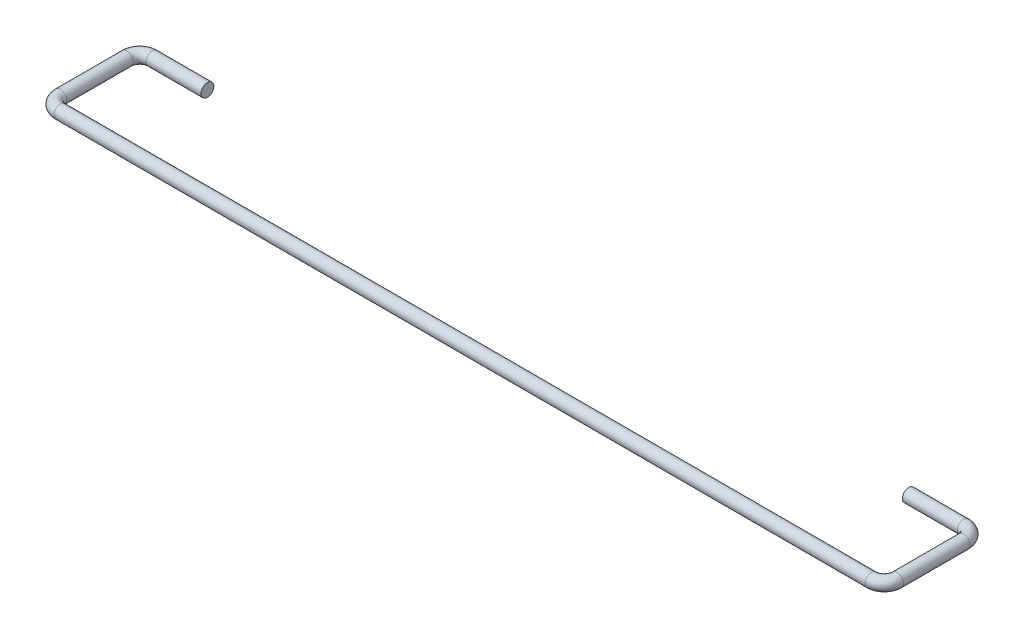
ISO-10303-21;
HEADER;
FILE_DESCRIPTION(('STEP AP214'),'2;1');
FILE_NAME('part.step','',(''),(''),'','','');
FILE_SCHEMA(('AUTOMOTIVE_DESIGN { 1 0 10303 214 1 1 1 1 }'));
ENDSEC;
DATA;
#1=APPLICATION_CONTEXT('core data for automotive mechanical design processes');
#2=APPLICATION_PROTOCOL_DEFINITION('international standard','automotive_design',2000,#1);
#3=PRODUCT_CONTEXT('',#1,'mechanical');
#4=PRODUCT('Part','Part','',(#3));
#5=PRODUCT_RELATED_PRODUCT_CATEGORY('part','',(#4));
#6=PRODUCT_DEFINITION_FORMATION('','',#4);
#7=PRODUCT_DEFINITION_CONTEXT('part definition',#1,'design');
#8=PRODUCT_DEFINITION('design','',#6,#7);
#9=PRODUCT_DEFINITION_SHAPE('','',#8);
#10=(LENGTH_UNIT() NAMED_UNIT(*) SI_UNIT(.MILLI.,.METRE.));
#11=(NAMED_UNIT(*) PLANE_ANGLE_UNIT() SI_UNIT($,.RADIAN.));
#12=(NAMED_UNIT(*) SI_UNIT($,.STERADIAN.) SOLID_ANGLE_UNIT());
#13=UNCERTAINTY_MEASURE_WITH_UNIT(LENGTH_MEASURE(1.E-05),#10,'distance_accuracy_value','');
#14=(GEOMETRIC_REPRESENTATION_CONTEXT(3) GLOBAL_UNCERTAINTY_ASSIGNED_CONTEXT((#13)) GLOBAL_UNIT_ASSIGNED_CONTEXT((#10,
#11,#12)) REPRESENTATION_CONTEXT('',''));
#15=CARTESIAN_POINT('',(0.,0.,0.));
#16=DIRECTION('',(0.,0.,1.));
#17=DIRECTION('',(1.,0.,0.));
#18=AXIS2_PLACEMENT_3D('',#15,#16,#17);
#19=CARTESIAN_POINT('',(43.7500000000001,0.,-11.5000000000006));
#20=DIRECTION('',(1.,0.,0.));
#21=DIRECTION('',(0.,0.,-1.));
#22=AXIS2_PLACEMENT_3D('',#19,#20,#21);
#23=PLANE('',#22);
#24=CARTESIAN_POINT('',(43.7500000000001,0.,-11.5000000000006));
#25=DIRECTION('',(1.,0.,0.));
#26=DIRECTION('',(0.,0.,-1.));
#27=AXIS2_PLACEMENT_3D('',#24,#25,#26);
#28=CIRCLE('',#27,0.800000000000001);
#29=CARTESIAN_POINT('',(43.7500000000001,0.,-12.3000000000006));
#30=VERTEX_POINT('',#29);
#31=EDGE_CURVE('E44',#30,#30,#28,.T.);
#32=ORIENTED_EDGE('',*,*,#31,.F.);
#33=EDGE_LOOP('',(#32));
#34=FACE_BOUND('',#33,.T.);
#35=ADVANCED_FACE('F32',(#34),#23,.F.);
#36=CARTESIAN_POINT('',(-43.75,0.,-11.5));
#37=DIRECTION('',(1.,0.,0.));
#38=DIRECTION('',(0.,0.,-1.));
#39=AXIS2_PLACEMENT_3D('',#36,#37,#38);
#40=PLANE('',#39);
#41=CARTESIAN_POINT('',(-43.75,0.,-11.5));
#42=DIRECTION('',(1.,0.,0.));
#43=DIRECTION('',(0.,0.,-1.));
#44=AXIS2_PLACEMENT_3D('',#41,#42,#43);
#45=CIRCLE('',#44,0.800000000000001);
#46=CARTESIAN_POINT('',(-43.75,0.,-12.3));
#47=VERTEX_POINT('',#46);
#48=EDGE_CURVE('E11',#47,#47,#45,.T.);
#49=ORIENTED_EDGE('',*,*,#48,.T.);
#50=EDGE_LOOP('',(#49));
#51=FACE_BOUND('',#50,.T.);
#52=ADVANCED_FACE('F47',(#51),#40,.T.);
#53=CARTESIAN_POINT('',(43.7500000000001,0.,-11.5000000000006));
#54=DIRECTION('',(1.,0.,0.));
#55=DIRECTION('',(0.,0.,-1.));
#56=AXIS2_PLACEMENT_3D('',#53,#54,#55);
#57=CYLINDRICAL_SURFACE('',#56,0.800000000000001);
#58=CARTESIAN_POINT('',(50.6000000000002,0.,-11.5000000000006));
#59=DIRECTION('',(1.,0.,0.));
#60=DIRECTION('',(0.,0.,-1.));
#61=AXIS2_PLACEMENT_3D('',#58,#59,#60);
#62=CIRCLE('',#61,0.800000000000001);
#63=CARTESIAN_POINT('',(50.6000000000002,0.,-12.3000000000001));
#64=VERTEX_POINT('',#63);
#65=EDGE_CURVE('E76',#64,#64,#62,.T.);
#66=ORIENTED_EDGE('',*,*,#65,.F.);
#67=EDGE_LOOP('',(#66));
#68=FACE_BOUND('',#67,.T.);
#69=ORIENTED_EDGE('',*,*,#31,.T.);
#70=EDGE_LOOP('',(#69));
#71=FACE_BOUND('',#70,.T.);
#72=ADVANCED_FACE('F80',(#68,#71),#57,.T.);
#73=CARTESIAN_POINT('',(50.6,0.,-9.9));
#74=DIRECTION('',(0.,-1.,0.));
#75=DIRECTION('',(0.,0.,-1.));
#76=AXIS2_PLACEMENT_3D('',#73,#74,#75);
#77=TOROIDAL_SURFACE('',#76,1.60000000000011,0.800000000000001);
#78=CARTESIAN_POINT('',(52.2,0.,-9.9));
#79=DIRECTION('',(0.,0.,1.));
#80=DIRECTION('',(1.,0.,0.));
#81=AXIS2_PLACEMENT_3D('',#78,#79,#80);
#82=CIRCLE('',#81,0.800000000000001);
#83=CARTESIAN_POINT('',(53.0000000000001,0.,-9.9));
#84=VERTEX_POINT('',#83);
#85=EDGE_CURVE('E73',#84,#84,#82,.T.);
#86=CARTESIAN_POINT('',(50.6,0.,-9.9));
#87=DIRECTION('',(0.,-1.,0.));
#88=DIRECTION('',(0.,0.,-1.));
#89=AXIS2_PLACEMENT_3D('',#86,#87,#88);
#90=CIRCLE('',#89,2.40000000000011);
#91=EDGE_CURVE('',#64,#84,#90,.T.);
#92=ORIENTED_EDGE('',*,*,#65,.T.);
#93=ORIENTED_EDGE('',*,*,#85,.F.);
#94=ORIENTED_EDGE('',*,*,#91,.T.);
#95=ORIENTED_EDGE('',*,*,#91,.F.);
#96=EDGE_LOOP('',(#92,#94,#93,#95));
#97=FACE_BOUND('',#96,.T.);
#98=ADVANCED_FACE('F82',(#97),#77,.T.);
#99=CARTESIAN_POINT('',(52.2,0.,-9.90000000000001));
#100=DIRECTION('',(0.,0.,1.));
#101=DIRECTION('',(1.,0.,0.));
#102=AXIS2_PLACEMENT_3D('',#99,#100,#101);
#103=CYLINDRICAL_SURFACE('',#102,0.800000000000001);
#104=CARTESIAN_POINT('',(52.2,0.,-1.60000000000001));
#105=DIRECTION('',(0.,0.,1.));
#106=DIRECTION('',(1.,0.,0.));
#107=AXIS2_PLACEMENT_3D('',#104,#105,#106);
#108=CIRCLE('',#107,0.800000000000001);
#109=CARTESIAN_POINT('',(53.,0.,-1.60000000000002));
#110=VERTEX_POINT('',#109);
#111=EDGE_CURVE('E70',#110,#110,#108,.T.);
#112=ORIENTED_EDGE('',*,*,#111,.F.);
#113=EDGE_LOOP('',(#112));
#114=FACE_BOUND('',#113,.T.);
#115=ORIENTED_EDGE('',*,*,#85,.T.);
#116=EDGE_LOOP('',(#115));
#117=FACE_BOUND('',#116,.T.);
#118=ADVANCED_FACE('F89',(#114,#117),#103,.T.);
#119=CARTESIAN_POINT('',(50.6,0.,-1.6));
#120=DIRECTION('',(0.,-1.,0.));
#121=DIRECTION('',(0.,0.,-1.));
#122=AXIS2_PLACEMENT_3D('',#119,#120,#121);
#123=TOROIDAL_SURFACE('',#122,1.6,0.800000000000001);
#124=CARTESIAN_POINT('',(50.6,0.,0.));
#125=DIRECTION('',(-1.,0.,0.));
#126=DIRECTION('',(0.,0.,1.));
#127=AXIS2_PLACEMENT_3D('',#124,#125,#126);
#128=CIRCLE('',#127,0.800000000000001);
#129=CARTESIAN_POINT('',(50.6,0.,0.799999999999997));
#130=VERTEX_POINT('',#129);
#131=EDGE_CURVE('E67',#130,#130,#128,.T.);
#132=CARTESIAN_POINT('',(50.6,0.,-1.6));
#133=DIRECTION('',(0.,-1.,0.));
#134=DIRECTION('',(0.,0.,-1.));
#135=AXIS2_PLACEMENT_3D('',#132,#133,#134);
#136=CIRCLE('',#135,2.4);
#137=EDGE_CURVE('',#110,#130,#136,.T.);
#138=ORIENTED_EDGE('',*,*,#111,.T.);
#139=ORIENTED_EDGE('',*,*,#131,.F.);
#140=ORIENTED_EDGE('',*,*,#137,.T.);
#141=ORIENTED_EDGE('',*,*,#137,.F.);
#142=EDGE_LOOP('',(#138,#140,#139,#141));
#143=FACE_BOUND('',#142,.T.);
#144=ADVANCED_FACE('F96',(#143),#123,.T.);
#145=CARTESIAN_POINT('',(50.6,0.,0.));
#146=DIRECTION('',(-1.,0.,0.));
#147=DIRECTION('',(0.,0.,1.));
#148=AXIS2_PLACEMENT_3D('',#145,#146,#147);
#149=CYLINDRICAL_SURFACE('',#148,0.800000000000001);
#150=CARTESIAN_POINT('',(-50.6,0.,0.));
#151=DIRECTION('',(-1.,0.,0.));
#152=DIRECTION('',(0.,0.,1.));
#153=AXIS2_PLACEMENT_3D('',#150,#151,#152);
#154=CIRCLE('',#153,0.800000000000001);
#155=CARTESIAN_POINT('',(-50.6,0.,0.799999999999999));
#156=VERTEX_POINT('',#155);
#157=EDGE_CURVE('E64',#156,#156,#154,.T.);
#158=ORIENTED_EDGE('',*,*,#157,.F.);
#159=EDGE_LOOP('',(#158));
#160=FACE_BOUND('',#159,.T.);
#161=ORIENTED_EDGE('',*,*,#131,.T.);
#162=EDGE_LOOP('',(#161));
#163=FACE_BOUND('',#162,.T.);
#164=ADVANCED_FACE('F100',(#160,#163),#149,.T.);
#165=CARTESIAN_POINT('',(-50.6,0.,-1.6));
#166=DIRECTION('',(0.,-1.,0.));
#167=DIRECTION('',(0.,0.,-1.));
#168=AXIS2_PLACEMENT_3D('',#165,#166,#167);
#169=TOROIDAL_SURFACE('',#168,1.6,0.800000000000001);
#170=CARTESIAN_POINT('',(-52.2,0.,-1.6));
#171=DIRECTION('',(0.,0.,-1.));
#172=DIRECTION('',(-1.,0.,0.));
#173=AXIS2_PLACEMENT_3D('',#170,#171,#172);
#174=CIRCLE('',#173,0.800000000000001);
#175=CARTESIAN_POINT('',(-53.,0.,-1.60000000000001));
#176=VERTEX_POINT('',#175);
#177=EDGE_CURVE('E59',#176,#176,#174,.T.);
#178=CARTESIAN_POINT('',(-50.6,0.,-1.6));
#179=DIRECTION('',(0.,-1.,0.));
#180=DIRECTION('',(0.,0.,-1.));
#181=AXIS2_PLACEMENT_3D('',#178,#179,#180);
#182=CIRCLE('',#181,2.4);
#183=EDGE_CURVE('',#156,#176,#182,.T.);
#184=ORIENTED_EDGE('',*,*,#157,.T.);
#185=ORIENTED_EDGE('',*,*,#177,.F.);
#186=ORIENTED_EDGE('',*,*,#183,.T.);
#187=ORIENTED_EDGE('',*,*,#183,.F.);
#188=EDGE_LOOP('',(#184,#186,#185,#187));
#189=FACE_BOUND('',#188,.T.);
#190=ADVANCED_FACE('F104',(#189),#169,.T.);
#191=CARTESIAN_POINT('',(-52.2,0.,-1.6));
#192=DIRECTION('',(0.,0.,-1.));
#193=DIRECTION('',(-1.,0.,0.));
#194=AXIS2_PLACEMENT_3D('',#191,#192,#193);
#195=CYLINDRICAL_SURFACE('',#194,0.800000000000001);
#196=CARTESIAN_POINT('',(-52.2,0.,-9.9));
#197=DIRECTION('',(0.,0.,-1.));
#198=DIRECTION('',(-1.,0.,0.));
#199=AXIS2_PLACEMENT_3D('',#196,#197,#198);
#200=CIRCLE('',#199,0.800000000000001);
#201=CARTESIAN_POINT('',(-53.,0.,-9.9));
#202=VERTEX_POINT('',#201);
#203=EDGE_CURVE('E57',#202,#202,#200,.T.);
#204=ORIENTED_EDGE('',*,*,#203,.F.);
#205=EDGE_LOOP('',(#204));
#206=FACE_BOUND('',#205,.T.);
#207=ORIENTED_EDGE('',*,*,#177,.T.);
#208=EDGE_LOOP('',(#207));
#209=FACE_BOUND('',#208,.T.);
#210=ADVANCED_FACE('F108',(#206,#209),#195,.T.);
#211=CARTESIAN_POINT('',(-50.6,0.,-9.9));
#212=DIRECTION('',(0.,-1.,0.));
#213=DIRECTION('',(0.,0.,-1.));
#214=AXIS2_PLACEMENT_3D('',#211,#212,#213);
#215=TOROIDAL_SURFACE('',#214,1.6,0.800000000000001);
#216=CARTESIAN_POINT('',(-50.5999999999999,0.,-11.5000000000005));
#217=DIRECTION('',(1.,0.,0.));
#218=DIRECTION('',(0.,0.,-1.));
#219=AXIS2_PLACEMENT_3D('',#216,#217,#218);
#220=CIRCLE('',#219,0.800000000000001);
#221=CARTESIAN_POINT('',(-50.5999999999998,0.,-12.3));
#222=VERTEX_POINT('',#221);
#223=EDGE_CURVE('E39',#222,#222,#220,.T.);
#224=CARTESIAN_POINT('',(-50.6,0.,-9.9));
#225=DIRECTION('',(0.,-1.,0.));
#226=DIRECTION('',(0.,0.,-1.));
#227=AXIS2_PLACEMENT_3D('',#224,#225,#226);
#228=CIRCLE('',#227,2.4);
#229=EDGE_CURVE('',#202,#222,#228,.T.);
#230=ORIENTED_EDGE('',*,*,#203,.T.);
#231=ORIENTED_EDGE('',*,*,#223,.F.);
#232=ORIENTED_EDGE('',*,*,#229,.T.);
#233=ORIENTED_EDGE('',*,*,#229,.F.);
#234=EDGE_LOOP('',(#230,#232,#231,#233));
#235=FACE_BOUND('',#234,.T.);
#236=ADVANCED_FACE('F52',(#235),#215,.T.);
#237=CARTESIAN_POINT('',(-50.6,0.,-11.5));
#238=DIRECTION('',(1.,0.,0.));
#239=DIRECTION('',(0.,0.,-1.));
#240=AXIS2_PLACEMENT_3D('',#237,#238,#239);
#241=CYLINDRICAL_SURFACE('',#240,0.800000000000001);
#242=ORIENTED_EDGE('',*,*,#48,.F.);
#243=EDGE_LOOP('',(#242));
#244=FACE_BOUND('',#243,.T.);
#245=ORIENTED_EDGE('',*,*,#223,.T.);
#246=EDGE_LOOP('',(#245));
#247=FACE_BOUND('',#246,.T.);
#248=ADVANCED_FACE('F49',(#244,#247),#241,.T.);
#249=CLOSED_SHELL('',(#35,#52,#72,#98,#118,#144,#164,#190,#210,#236,#248));
#250=MANIFOLD_SOLID_BREP('B2',#249);
#251=ADVANCED_BREP_SHAPE_REPRESENTATION('',(#18,#250),#14);
#252=SHAPE_DEFINITION_REPRESENTATION(#9,#251);
ENDSEC;
END-ISO-10303-21;
